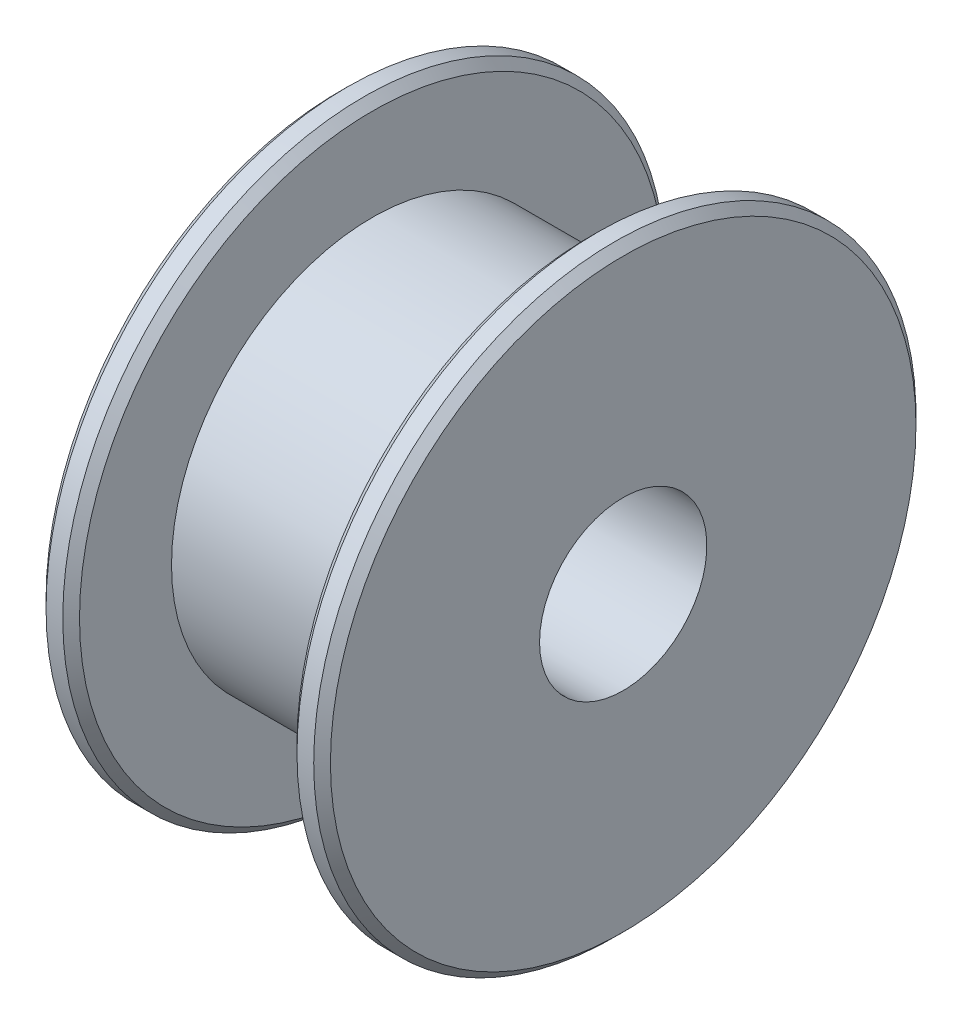
ISO-10303-21;
HEADER;
FILE_DESCRIPTION(('STEP AP214'),'2;1');
FILE_NAME('part.step','',(''),(''),'','','');
FILE_SCHEMA(('AUTOMOTIVE_DESIGN { 1 0 10303 214 1 1 1 1 }'));
ENDSEC;
DATA;
#1=APPLICATION_CONTEXT('core data for automotive mechanical design processes');
#2=APPLICATION_PROTOCOL_DEFINITION('international standard','automotive_design',2000,#1);
#3=PRODUCT_CONTEXT('',#1,'mechanical');
#4=PRODUCT('Part','Part','',(#3));
#5=PRODUCT_RELATED_PRODUCT_CATEGORY('part','',(#4));
#6=PRODUCT_DEFINITION_FORMATION('','',#4);
#7=PRODUCT_DEFINITION_CONTEXT('part definition',#1,'design');
#8=PRODUCT_DEFINITION('design','',#6,#7);
#9=PRODUCT_DEFINITION_SHAPE('','',#8);
#10=(LENGTH_UNIT() NAMED_UNIT(*) SI_UNIT(.MILLI.,.METRE.));
#11=(NAMED_UNIT(*) PLANE_ANGLE_UNIT() SI_UNIT($,.RADIAN.));
#12=(NAMED_UNIT(*) SI_UNIT($,.STERADIAN.) SOLID_ANGLE_UNIT());
#13=UNCERTAINTY_MEASURE_WITH_UNIT(LENGTH_MEASURE(1.E-05),#10,'distance_accuracy_value','');
#14=(GEOMETRIC_REPRESENTATION_CONTEXT(3) GLOBAL_UNCERTAINTY_ASSIGNED_CONTEXT((#13)) GLOBAL_UNIT_ASSIGNED_CONTEXT((#10,
#11,#12)) REPRESENTATION_CONTEXT('',''));
#15=CARTESIAN_POINT('',(0.,0.,0.));
#16=DIRECTION('',(0.,0.,1.));
#17=DIRECTION('',(1.,0.,0.));
#18=AXIS2_PLACEMENT_3D('',#15,#16,#17);
#19=CARTESIAN_POINT('',(0.,0.,0.));
#20=DIRECTION('',(-1.,0.,0.));
#21=DIRECTION('',(0.,0.,1.));
#22=AXIS2_PLACEMENT_3D('',#19,#20,#21);
#23=CYLINDRICAL_SURFACE('',#22,2.5);
#24=CARTESIAN_POINT('',(8.5,0.,0.));
#25=DIRECTION('',(-1.,0.,0.));
#26=DIRECTION('',(0.,0.,1.));
#27=AXIS2_PLACEMENT_3D('',#24,#25,#26);
#28=CIRCLE('',#27,2.5);
#29=CARTESIAN_POINT('',(8.5,0.,2.5));
#30=VERTEX_POINT('',#29);
#31=EDGE_CURVE('E77',#30,#30,#28,.T.);
#32=ORIENTED_EDGE('',*,*,#31,.F.);
#33=EDGE_LOOP('',(#32));
#34=FACE_BOUND('',#33,.T.);
#35=CARTESIAN_POINT('',(0.,0.,0.));
#36=DIRECTION('',(-1.,0.,0.));
#37=DIRECTION('',(0.,0.,1.));
#38=AXIS2_PLACEMENT_3D('',#35,#36,#37);
#39=CIRCLE('',#38,2.5);
#40=CARTESIAN_POINT('',(0.,0.,2.5));
#41=VERTEX_POINT('',#40);
#42=EDGE_CURVE('E68',#41,#41,#39,.T.);
#43=ORIENTED_EDGE('',*,*,#42,.T.);
#44=EDGE_LOOP('',(#43));
#45=FACE_BOUND('',#44,.T.);
#46=ADVANCED_FACE('F35',(#34,#45),#23,.F.);
#47=CARTESIAN_POINT('',(0.,2.5,0.));
#48=DIRECTION('',(1.,0.,0.));
#49=DIRECTION('',(0.,0.,-1.));
#50=AXIS2_PLACEMENT_3D('',#47,#48,#49);
#51=PLANE('',#50);
#52=CARTESIAN_POINT('',(0.,0.,0.));
#53=DIRECTION('',(1.,0.,0.));
#54=DIRECTION('',(0.,0.,-1.));
#55=AXIS2_PLACEMENT_3D('',#52,#53,#54);
#56=CIRCLE('',#55,8.75);
#57=CARTESIAN_POINT('',(0.,0.,-8.75));
#58=VERTEX_POINT('',#57);
#59=EDGE_CURVE('E10',#58,#58,#56,.F.);
#60=ORIENTED_EDGE('',*,*,#59,.T.);
#61=EDGE_LOOP('',(#60));
#62=FACE_BOUND('',#61,.T.);
#63=ORIENTED_EDGE('',*,*,#42,.F.);
#64=EDGE_LOOP('',(#63));
#65=FACE_BOUND('',#64,.T.);
#66=ADVANCED_FACE('F85',(#62,#65),#51,.F.);
#67=CARTESIAN_POINT('',(0.,0.,0.));
#68=DIRECTION('',(-1.,0.,0.));
#69=DIRECTION('',(0.,0.,1.));
#70=AXIS2_PLACEMENT_3D('',#67,#68,#69);
#71=CYLINDRICAL_SURFACE('',#70,9.);
#72=CARTESIAN_POINT('',(0.750000000000005,0.,0.));
#73=DIRECTION('',(-1.,0.,0.));
#74=DIRECTION('',(0.,0.,1.));
#75=AXIS2_PLACEMENT_3D('',#72,#73,#74);
#76=CIRCLE('',#75,9.);
#77=CARTESIAN_POINT('',(0.750000000000005,0.,9.));
#78=VERTEX_POINT('',#77);
#79=EDGE_CURVE('E62',#78,#78,#76,.T.);
#80=ORIENTED_EDGE('',*,*,#79,.T.);
#81=EDGE_LOOP('',(#80));
#82=FACE_BOUND('',#81,.T.);
#83=CARTESIAN_POINT('',(0.250000000000002,0.,0.));
#84=DIRECTION('',(1.,0.,0.));
#85=DIRECTION('',(0.,0.,-1.));
#86=AXIS2_PLACEMENT_3D('',#83,#84,#85);
#87=CIRCLE('',#86,9.);
#88=CARTESIAN_POINT('',(0.250000000000002,0.,-9.));
#89=VERTEX_POINT('',#88);
#90=EDGE_CURVE('E65',#89,#89,#87,.T.);
#91=ORIENTED_EDGE('',*,*,#90,.T.);
#92=EDGE_LOOP('',(#91));
#93=FACE_BOUND('',#92,.T.);
#94=ADVANCED_FACE('F90',(#82,#93),#71,.T.);
#95=CARTESIAN_POINT('',(1.,9.,0.));
#96=DIRECTION('',(-1.,0.,0.));
#97=DIRECTION('',(0.,0.,1.));
#98=AXIS2_PLACEMENT_3D('',#95,#96,#97);
#99=PLANE('',#98);
#100=CARTESIAN_POINT('',(1.,0.,0.));
#101=DIRECTION('',(-1.,0.,0.));
#102=DIRECTION('',(0.,0.,1.));
#103=AXIS2_PLACEMENT_3D('',#100,#101,#102);
#104=CIRCLE('',#103,8.75);
#105=CARTESIAN_POINT('',(1.,0.,8.75));
#106=VERTEX_POINT('',#105);
#107=EDGE_CURVE('E59',#106,#106,#104,.F.);
#108=ORIENTED_EDGE('',*,*,#107,.T.);
#109=EDGE_LOOP('',(#108));
#110=FACE_BOUND('',#109,.T.);
#111=CARTESIAN_POINT('',(1.,0.,0.));
#112=DIRECTION('',(-1.,0.,0.));
#113=DIRECTION('',(0.,0.,1.));
#114=AXIS2_PLACEMENT_3D('',#111,#112,#113);
#115=CIRCLE('',#114,6.);
#116=CARTESIAN_POINT('',(1.,0.,6.));
#117=VERTEX_POINT('',#116);
#118=EDGE_CURVE('E71',#117,#117,#115,.T.);
#119=ORIENTED_EDGE('',*,*,#118,.T.);
#120=EDGE_LOOP('',(#119));
#121=FACE_BOUND('',#120,.T.);
#122=ADVANCED_FACE('F95',(#110,#121),#99,.F.);
#123=CARTESIAN_POINT('',(0.,0.,0.));
#124=DIRECTION('',(-1.,0.,0.));
#125=DIRECTION('',(0.,0.,1.));
#126=AXIS2_PLACEMENT_3D('',#123,#124,#125);
#127=CYLINDRICAL_SURFACE('',#126,6.);
#128=ORIENTED_EDGE('',*,*,#118,.F.);
#129=EDGE_LOOP('',(#128));
#130=FACE_BOUND('',#129,.T.);
#131=CARTESIAN_POINT('',(7.5,0.,0.));
#132=DIRECTION('',(-1.,0.,0.));
#133=DIRECTION('',(0.,0.,1.));
#134=AXIS2_PLACEMENT_3D('',#131,#132,#133);
#135=CIRCLE('',#134,6.);
#136=CARTESIAN_POINT('',(7.5,0.,6.));
#137=VERTEX_POINT('',#136);
#138=EDGE_CURVE('E74',#137,#137,#135,.T.);
#139=ORIENTED_EDGE('',*,*,#138,.T.);
#140=EDGE_LOOP('',(#139));
#141=FACE_BOUND('',#140,.T.);
#142=ADVANCED_FACE('F136',(#130,#141),#127,.T.);
#143=CARTESIAN_POINT('',(7.5,6.,0.));
#144=DIRECTION('',(1.,0.,0.));
#145=DIRECTION('',(0.,0.,-1.));
#146=AXIS2_PLACEMENT_3D('',#143,#144,#145);
#147=PLANE('',#146);
#148=CARTESIAN_POINT('',(7.5,0.,0.));
#149=DIRECTION('',(1.,0.,0.));
#150=DIRECTION('',(0.,0.,-1.));
#151=AXIS2_PLACEMENT_3D('',#148,#149,#150);
#152=CIRCLE('',#151,8.75000000000001);
#153=CARTESIAN_POINT('',(7.5,0.,-8.75000000000001));
#154=VERTEX_POINT('',#153);
#155=EDGE_CURVE('E56',#154,#154,#152,.F.);
#156=ORIENTED_EDGE('',*,*,#155,.T.);
#157=EDGE_LOOP('',(#156));
#158=FACE_BOUND('',#157,.T.);
#159=ORIENTED_EDGE('',*,*,#138,.F.);
#160=EDGE_LOOP('',(#159));
#161=FACE_BOUND('',#160,.T.);
#162=ADVANCED_FACE('F128',(#158,#161),#147,.F.);
#163=CARTESIAN_POINT('',(0.,0.,0.));
#164=DIRECTION('',(-1.,0.,0.));
#165=DIRECTION('',(0.,0.,1.));
#166=AXIS2_PLACEMENT_3D('',#163,#164,#165);
#167=CYLINDRICAL_SURFACE('',#166,9.);
#168=CARTESIAN_POINT('',(7.75,0.,0.));
#169=DIRECTION('',(1.,0.,0.));
#170=DIRECTION('',(0.,0.,-1.));
#171=AXIS2_PLACEMENT_3D('',#168,#169,#170);
#172=CIRCLE('',#171,9.);
#173=CARTESIAN_POINT('',(7.75,0.,-9.));
#174=VERTEX_POINT('',#173);
#175=EDGE_CURVE('E47',#174,#174,#172,.T.);
#176=ORIENTED_EDGE('',*,*,#175,.T.);
#177=EDGE_LOOP('',(#176));
#178=FACE_BOUND('',#177,.T.);
#179=CARTESIAN_POINT('',(8.25000000000001,0.,0.));
#180=DIRECTION('',(-1.,0.,0.));
#181=DIRECTION('',(0.,0.,1.));
#182=AXIS2_PLACEMENT_3D('',#179,#180,#181);
#183=CIRCLE('',#182,9.);
#184=CARTESIAN_POINT('',(8.25000000000001,0.,9.));
#185=VERTEX_POINT('',#184);
#186=EDGE_CURVE('E51',#185,#185,#183,.T.);
#187=ORIENTED_EDGE('',*,*,#186,.T.);
#188=EDGE_LOOP('',(#187));
#189=FACE_BOUND('',#188,.T.);
#190=ADVANCED_FACE('F126',(#178,#189),#167,.T.);
#191=CARTESIAN_POINT('',(8.5,9.,0.));
#192=DIRECTION('',(-1.,0.,0.));
#193=DIRECTION('',(0.,0.,1.));
#194=AXIS2_PLACEMENT_3D('',#191,#192,#193);
#195=PLANE('',#194);
#196=CARTESIAN_POINT('',(8.5,0.,0.));
#197=DIRECTION('',(-1.,0.,0.));
#198=DIRECTION('',(0.,0.,1.));
#199=AXIS2_PLACEMENT_3D('',#196,#197,#198);
#200=CIRCLE('',#199,8.75);
#201=CARTESIAN_POINT('',(8.5,0.,8.75));
#202=VERTEX_POINT('',#201);
#203=EDGE_CURVE('E43',#202,#202,#200,.F.);
#204=ORIENTED_EDGE('',*,*,#203,.T.);
#205=EDGE_LOOP('',(#204));
#206=FACE_BOUND('',#205,.T.);
#207=ORIENTED_EDGE('',*,*,#31,.T.);
#208=EDGE_LOOP('',(#207));
#209=FACE_BOUND('',#208,.T.);
#210=ADVANCED_FACE('F81',(#206,#209),#195,.F.);
#211=CARTESIAN_POINT('',(0.750000000000005,0.,0.));
#212=DIRECTION('',(-1.,0.,0.));
#213=DIRECTION('',(0.,0.,1.));
#214=AXIS2_PLACEMENT_3D('',#211,#212,#213);
#215=CONICAL_SURFACE('',#214,9.,0.785398163397448);
#216=ORIENTED_EDGE('',*,*,#107,.F.);
#217=EDGE_LOOP('',(#216));
#218=FACE_BOUND('',#217,.T.);
#219=ORIENTED_EDGE('',*,*,#79,.F.);
#220=EDGE_LOOP('',(#219));
#221=FACE_BOUND('',#220,.T.);
#222=ADVANCED_FACE('F101',(#218,#221),#215,.T.);
#223=CARTESIAN_POINT('',(7.5,0.,0.));
#224=DIRECTION('',(1.,0.,0.));
#225=DIRECTION('',(0.,0.,-1.));
#226=AXIS2_PLACEMENT_3D('',#223,#224,#225);
#227=CONICAL_SURFACE('',#226,8.75000000000001,0.785398163397434);
#228=ORIENTED_EDGE('',*,*,#175,.F.);
#229=EDGE_LOOP('',(#228));
#230=FACE_BOUND('',#229,.T.);
#231=ORIENTED_EDGE('',*,*,#155,.F.);
#232=EDGE_LOOP('',(#231));
#233=FACE_BOUND('',#232,.T.);
#234=ADVANCED_FACE('F107',(#230,#233),#227,.T.);
#235=CARTESIAN_POINT('',(8.25000000000001,0.,0.));
#236=DIRECTION('',(-1.,0.,0.));
#237=DIRECTION('',(0.,0.,1.));
#238=AXIS2_PLACEMENT_3D('',#235,#236,#237);
#239=CONICAL_SURFACE('',#238,9.,0.785398163397455);
#240=ORIENTED_EDGE('',*,*,#203,.F.);
#241=EDGE_LOOP('',(#240));
#242=FACE_BOUND('',#241,.T.);
#243=ORIENTED_EDGE('',*,*,#186,.F.);
#244=EDGE_LOOP('',(#243));
#245=FACE_BOUND('',#244,.T.);
#246=ADVANCED_FACE('F113',(#242,#245),#239,.T.);
#247=CARTESIAN_POINT('',(0.,0.,0.));
#248=DIRECTION('',(1.,0.,0.));
#249=DIRECTION('',(0.,0.,-1.));
#250=AXIS2_PLACEMENT_3D('',#247,#248,#249);
#251=CONICAL_SURFACE('',#250,8.75,0.785398163397441);
#252=ORIENTED_EDGE('',*,*,#90,.F.);
#253=EDGE_LOOP('',(#252));
#254=FACE_BOUND('',#253,.T.);
#255=ORIENTED_EDGE('',*,*,#59,.F.);
#256=EDGE_LOOP('',(#255));
#257=FACE_BOUND('',#256,.T.);
#258=ADVANCED_FACE('F38',(#254,#257),#251,.T.);
#259=CLOSED_SHELL('',(#46,#66,#94,#122,#142,#162,#190,#210,#222,#234,#246,#258));
#260=MANIFOLD_SOLID_BREP('B2',#259);
#261=ADVANCED_BREP_SHAPE_REPRESENTATION('',(#18,#260),#14);
#262=SHAPE_DEFINITION_REPRESENTATION(#9,#261);
ENDSEC;
END-ISO-10303-21;
